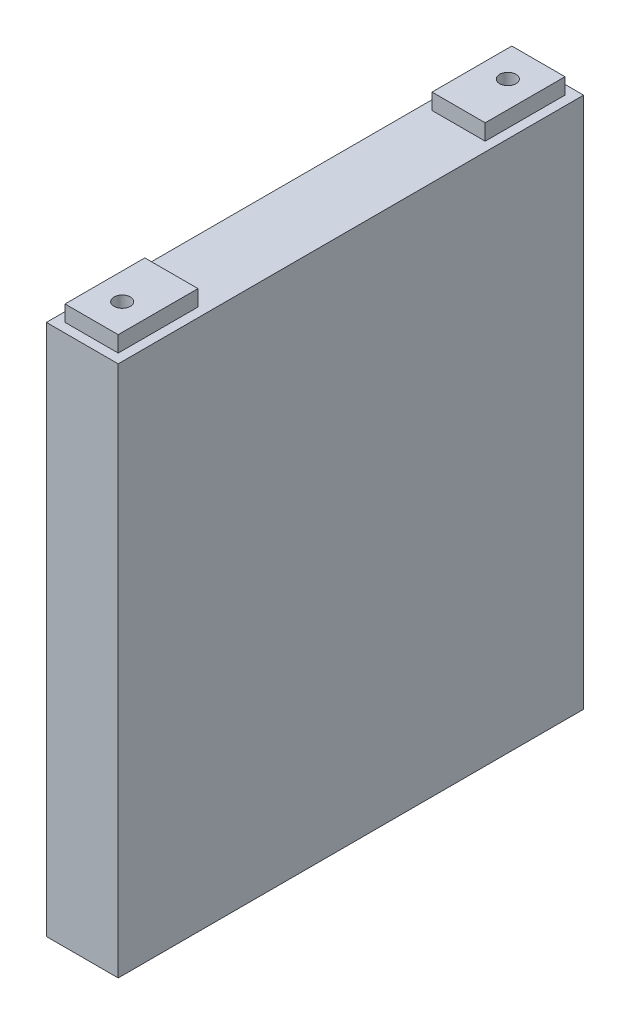
ISO-10303-21;
HEADER;
FILE_DESCRIPTION(('STEP AP214'),'2;1');
FILE_NAME('part.step','',(''),(''),'','','');
FILE_SCHEMA(('AUTOMOTIVE_DESIGN { 1 0 10303 214 1 1 1 1 }'));
ENDSEC;
DATA;
#1=APPLICATION_CONTEXT('core data for automotive mechanical design processes');
#2=APPLICATION_PROTOCOL_DEFINITION('international standard','automotive_design',2000,#1);
#3=PRODUCT_CONTEXT('',#1,'mechanical');
#4=PRODUCT('Part','Part','',(#3));
#5=PRODUCT_RELATED_PRODUCT_CATEGORY('part','',(#4));
#6=PRODUCT_DEFINITION_FORMATION('','',#4);
#7=PRODUCT_DEFINITION_CONTEXT('part definition',#1,'design');
#8=PRODUCT_DEFINITION('design','',#6,#7);
#9=PRODUCT_DEFINITION_SHAPE('','',#8);
#10=(LENGTH_UNIT() NAMED_UNIT(*) SI_UNIT(.MILLI.,.METRE.));
#11=(NAMED_UNIT(*) PLANE_ANGLE_UNIT() SI_UNIT($,.RADIAN.));
#12=(NAMED_UNIT(*) SI_UNIT($,.STERADIAN.) SOLID_ANGLE_UNIT());
#13=UNCERTAINTY_MEASURE_WITH_UNIT(LENGTH_MEASURE(1.E-05),#10,'distance_accuracy_value','');
#14=(GEOMETRIC_REPRESENTATION_CONTEXT(3) GLOBAL_UNCERTAINTY_ASSIGNED_CONTEXT((#13)) GLOBAL_UNIT_ASSIGNED_CONTEXT((#10,
#11,#12)) REPRESENTATION_CONTEXT('',''));
#15=CARTESIAN_POINT('',(0.,0.,0.));
#16=DIRECTION('',(0.,0.,1.));
#17=DIRECTION('',(1.,0.,0.));
#18=AXIS2_PLACEMENT_3D('',#15,#16,#17);
#19=CARTESIAN_POINT('',(13.5,200.,87.5));
#20=DIRECTION('',(-1.,0.,0.));
#21=DIRECTION('',(0.,0.,1.));
#22=AXIS2_PLACEMENT_3D('',#19,#20,#21);
#23=PLANE('',#22);
#24=DIRECTION('',(0.,0.,-1.));
#25=VECTOR('',#24,1.);
#26=CARTESIAN_POINT('',(13.5,0.,87.5));
#27=LINE('',#26,#25);
#28=CARTESIAN_POINT('',(13.5,0.,87.5));
#29=VERTEX_POINT('',#28);
#30=CARTESIAN_POINT('',(13.5,0.,-87.5));
#31=VERTEX_POINT('',#30);
#32=EDGE_CURVE('E235',#29,#31,#27,.T.);
#33=ORIENTED_EDGE('',*,*,#32,.T.);
#34=DIRECTION('',(0.,-1.,0.));
#35=VECTOR('',#34,1.);
#36=CARTESIAN_POINT('',(13.5,200.,-87.5));
#37=LINE('',#36,#35);
#38=CARTESIAN_POINT('',(13.5,200.,-87.5));
#39=VERTEX_POINT('',#38);
#40=EDGE_CURVE('E11',#39,#31,#37,.T.);
#41=ORIENTED_EDGE('',*,*,#40,.F.);
#42=DIRECTION('',(0.,0.,-1.));
#43=VECTOR('',#42,1.);
#44=CARTESIAN_POINT('',(13.5,200.,87.5));
#45=LINE('',#44,#43);
#46=CARTESIAN_POINT('',(13.5,200.,87.5));
#47=VERTEX_POINT('',#46);
#48=EDGE_CURVE('E236',#47,#39,#45,.T.);
#49=ORIENTED_EDGE('',*,*,#48,.F.);
#50=DIRECTION('',(0.,-1.,0.));
#51=VECTOR('',#50,1.);
#52=CARTESIAN_POINT('',(13.5,200.,87.5));
#53=LINE('',#52,#51);
#54=EDGE_CURVE('E250',#47,#29,#53,.T.);
#55=ORIENTED_EDGE('',*,*,#54,.T.);
#56=EDGE_LOOP('',(#33,#41,#49,#55));
#57=FACE_BOUND('',#56,.T.);
#58=ADVANCED_FACE('F43',(#57),#23,.F.);
#59=CARTESIAN_POINT('',(-13.5,200.,-87.5));
#60=DIRECTION('',(0.,0.,1.));
#61=DIRECTION('',(1.,0.,0.));
#62=AXIS2_PLACEMENT_3D('',#59,#60,#61);
#63=PLANE('',#62);
#64=DIRECTION('',(-1.,0.,0.));
#65=VECTOR('',#64,1.);
#66=CARTESIAN_POINT('',(-13.5,0.,-87.5));
#67=LINE('',#66,#65);
#68=CARTESIAN_POINT('',(-13.5,0.,-87.5));
#69=VERTEX_POINT('',#68);
#70=EDGE_CURVE('E254',#31,#69,#67,.T.);
#71=ORIENTED_EDGE('',*,*,#70,.T.);
#72=DIRECTION('',(0.,-1.,0.));
#73=VECTOR('',#72,1.);
#74=CARTESIAN_POINT('',(-13.5,200.,-87.5));
#75=LINE('',#74,#73);
#76=CARTESIAN_POINT('',(-13.5,200.,-87.5));
#77=VERTEX_POINT('',#76);
#78=EDGE_CURVE('E51',#77,#69,#75,.T.);
#79=ORIENTED_EDGE('',*,*,#78,.F.);
#80=DIRECTION('',(-1.,0.,0.));
#81=VECTOR('',#80,1.);
#82=CARTESIAN_POINT('',(-13.5,200.,-87.5));
#83=LINE('',#82,#81);
#84=EDGE_CURVE('E240',#39,#77,#83,.T.);
#85=ORIENTED_EDGE('',*,*,#84,.F.);
#86=ORIENTED_EDGE('',*,*,#40,.T.);
#87=EDGE_LOOP('',(#71,#79,#85,#86));
#88=FACE_BOUND('',#87,.T.);
#89=ADVANCED_FACE('F289',(#88),#63,.F.);
#90=CARTESIAN_POINT('',(-13.5,200.,87.5));
#91=DIRECTION('',(1.,0.,0.));
#92=DIRECTION('',(0.,0.,-1.));
#93=AXIS2_PLACEMENT_3D('',#90,#91,#92);
#94=PLANE('',#93);
#95=DIRECTION('',(0.,0.,1.));
#96=VECTOR('',#95,1.);
#97=CARTESIAN_POINT('',(-13.5,0.,87.5));
#98=LINE('',#97,#96);
#99=CARTESIAN_POINT('',(-13.5,0.,87.5));
#100=VERTEX_POINT('',#99);
#101=EDGE_CURVE('E257',#69,#100,#98,.T.);
#102=ORIENTED_EDGE('',*,*,#101,.T.);
#103=DIRECTION('',(0.,-1.,0.));
#104=VECTOR('',#103,1.);
#105=CARTESIAN_POINT('',(-13.5,200.,87.5));
#106=LINE('',#105,#104);
#107=CARTESIAN_POINT('',(-13.5,200.,87.5));
#108=VERTEX_POINT('',#107);
#109=EDGE_CURVE('E265',#108,#100,#106,.T.);
#110=ORIENTED_EDGE('',*,*,#109,.F.);
#111=DIRECTION('',(0.,0.,1.));
#112=VECTOR('',#111,1.);
#113=CARTESIAN_POINT('',(-13.5,200.,87.5));
#114=LINE('',#113,#112);
#115=EDGE_CURVE('E244',#77,#108,#114,.T.);
#116=ORIENTED_EDGE('',*,*,#115,.F.);
#117=ORIENTED_EDGE('',*,*,#78,.T.);
#118=EDGE_LOOP('',(#102,#110,#116,#117));
#119=FACE_BOUND('',#118,.T.);
#120=ADVANCED_FACE('F274',(#119),#94,.F.);
#121=CARTESIAN_POINT('',(-13.5,200.,87.5));
#122=DIRECTION('',(0.,0.,-1.));
#123=DIRECTION('',(-1.,0.,0.));
#124=AXIS2_PLACEMENT_3D('',#121,#122,#123);
#125=PLANE('',#124);
#126=DIRECTION('',(1.,0.,0.));
#127=VECTOR('',#126,1.);
#128=CARTESIAN_POINT('',(-13.5,0.,87.5));
#129=LINE('',#128,#127);
#130=EDGE_CURVE('E241',#100,#29,#129,.T.);
#131=ORIENTED_EDGE('',*,*,#130,.T.);
#132=ORIENTED_EDGE('',*,*,#54,.F.);
#133=DIRECTION('',(1.,0.,0.));
#134=VECTOR('',#133,1.);
#135=CARTESIAN_POINT('',(-13.5,200.,87.5));
#136=LINE('',#135,#134);
#137=EDGE_CURVE('E247',#108,#47,#136,.T.);
#138=ORIENTED_EDGE('',*,*,#137,.F.);
#139=ORIENTED_EDGE('',*,*,#109,.T.);
#140=EDGE_LOOP('',(#131,#132,#138,#139));
#141=FACE_BOUND('',#140,.T.);
#142=ADVANCED_FACE('F283',(#141),#125,.F.);
#143=CARTESIAN_POINT('',(0.,200.,0.));
#144=DIRECTION('',(0.,-1.,0.));
#145=DIRECTION('',(0.,0.,-1.));
#146=AXIS2_PLACEMENT_3D('',#143,#144,#145);
#147=PLANE('',#146);
#148=DIRECTION('',(0.,0.,-1.));
#149=VECTOR('',#148,1.);
#150=CARTESIAN_POINT('',(10.,200.,-54.));
#151=LINE('',#150,#149);
#152=CARTESIAN_POINT('',(10.,200.,-54.));
#153=VERTEX_POINT('',#152);
#154=CARTESIAN_POINT('',(10.,200.,-84.));
#155=VERTEX_POINT('',#154);
#156=EDGE_CURVE('E128',#153,#155,#151,.T.);
#157=ORIENTED_EDGE('',*,*,#156,.F.);
#158=DIRECTION('',(1.,0.,0.));
#159=VECTOR('',#158,1.);
#160=CARTESIAN_POINT('',(-10.,200.,-54.));
#161=LINE('',#160,#159);
#162=CARTESIAN_POINT('',(-10.,200.,-54.));
#163=VERTEX_POINT('',#162);
#164=EDGE_CURVE('E132',#163,#153,#161,.T.);
#165=ORIENTED_EDGE('',*,*,#164,.F.);
#166=DIRECTION('',(0.,0.,1.));
#167=VECTOR('',#166,1.);
#168=CARTESIAN_POINT('',(-10.,200.,-54.));
#169=LINE('',#168,#167);
#170=CARTESIAN_POINT('',(-10.,200.,-84.));
#171=VERTEX_POINT('',#170);
#172=EDGE_CURVE('E63',#171,#163,#169,.T.);
#173=ORIENTED_EDGE('',*,*,#172,.F.);
#174=DIRECTION('',(-1.,0.,0.));
#175=VECTOR('',#174,1.);
#176=CARTESIAN_POINT('',(-10.,200.,-84.));
#177=LINE('',#176,#175);
#178=EDGE_CURVE('E58',#155,#171,#177,.T.);
#179=ORIENTED_EDGE('',*,*,#178,.F.);
#180=EDGE_LOOP('',(#157,#165,#173,#179));
#181=FACE_BOUND('',#180,.T.);
#182=DIRECTION('',(0.,0.,-1.));
#183=VECTOR('',#182,1.);
#184=CARTESIAN_POINT('',(10.,200.,84.));
#185=LINE('',#184,#183);
#186=CARTESIAN_POINT('',(10.,200.,84.));
#187=VERTEX_POINT('',#186);
#188=CARTESIAN_POINT('',(10.,200.,54.));
#189=VERTEX_POINT('',#188);
#190=EDGE_CURVE('E187',#187,#189,#185,.T.);
#191=ORIENTED_EDGE('',*,*,#190,.F.);
#192=DIRECTION('',(1.,0.,0.));
#193=VECTOR('',#192,1.);
#194=CARTESIAN_POINT('',(-9.99999999999999,200.,84.));
#195=LINE('',#194,#193);
#196=CARTESIAN_POINT('',(-9.99999999999999,200.,84.));
#197=VERTEX_POINT('',#196);
#198=EDGE_CURVE('E196',#197,#187,#195,.T.);
#199=ORIENTED_EDGE('',*,*,#198,.F.);
#200=DIRECTION('',(0.,0.,1.));
#201=VECTOR('',#200,1.);
#202=CARTESIAN_POINT('',(-9.99999999999999,200.,84.));
#203=LINE('',#202,#201);
#204=CARTESIAN_POINT('',(-9.99999999999999,200.,54.));
#205=VERTEX_POINT('',#204);
#206=EDGE_CURVE('E213',#205,#197,#203,.T.);
#207=ORIENTED_EDGE('',*,*,#206,.F.);
#208=DIRECTION('',(-1.,0.,0.));
#209=VECTOR('',#208,1.);
#210=CARTESIAN_POINT('',(-9.99999999999999,200.,54.));
#211=LINE('',#210,#209);
#212=EDGE_CURVE('E209',#189,#205,#211,.T.);
#213=ORIENTED_EDGE('',*,*,#212,.F.);
#214=EDGE_LOOP('',(#191,#199,#207,#213));
#215=FACE_BOUND('',#214,.T.);
#216=ORIENTED_EDGE('',*,*,#48,.T.);
#217=ORIENTED_EDGE('',*,*,#84,.T.);
#218=ORIENTED_EDGE('',*,*,#115,.T.);
#219=ORIENTED_EDGE('',*,*,#137,.T.);
#220=EDGE_LOOP('',(#216,#217,#218,#219));
#221=FACE_BOUND('',#220,.T.);
#222=ADVANCED_FACE('F130',(#181,#215,#221),#147,.F.);
#223=CARTESIAN_POINT('',(0.,0.,0.));
#224=DIRECTION('',(0.,-1.,0.));
#225=DIRECTION('',(0.,0.,-1.));
#226=AXIS2_PLACEMENT_3D('',#223,#224,#225);
#227=PLANE('',#226);
#228=ORIENTED_EDGE('',*,*,#32,.F.);
#229=ORIENTED_EDGE('',*,*,#130,.F.);
#230=ORIENTED_EDGE('',*,*,#101,.F.);
#231=ORIENTED_EDGE('',*,*,#70,.F.);
#232=EDGE_LOOP('',(#228,#229,#230,#231));
#233=FACE_BOUND('',#232,.T.);
#234=ADVANCED_FACE('F280',(#233),#227,.T.);
#235=CARTESIAN_POINT('',(0.,206.,0.));
#236=DIRECTION('',(0.,-1.,0.));
#237=DIRECTION('',(0.,0.,-1.));
#238=AXIS2_PLACEMENT_3D('',#235,#236,#237);
#239=PLANE('',#238);
#240=DIRECTION('',(0.,0.,-1.));
#241=VECTOR('',#240,1.);
#242=CARTESIAN_POINT('',(10.,206.,84.));
#243=LINE('',#242,#241);
#244=CARTESIAN_POINT('',(10.,206.,84.));
#245=VERTEX_POINT('',#244);
#246=CARTESIAN_POINT('',(10.,206.,54.));
#247=VERTEX_POINT('',#246);
#248=EDGE_CURVE('E191',#245,#247,#243,.T.);
#249=ORIENTED_EDGE('',*,*,#248,.T.);
#250=DIRECTION('',(-1.,0.,0.));
#251=VECTOR('',#250,1.);
#252=CARTESIAN_POINT('',(-9.99999999999999,206.,54.));
#253=LINE('',#252,#251);
#254=CARTESIAN_POINT('',(-9.99999999999999,206.,54.));
#255=VERTEX_POINT('',#254);
#256=EDGE_CURVE('E195',#247,#255,#253,.T.);
#257=ORIENTED_EDGE('',*,*,#256,.T.);
#258=DIRECTION('',(0.,0.,1.));
#259=VECTOR('',#258,1.);
#260=CARTESIAN_POINT('',(-9.99999999999999,206.,84.));
#261=LINE('',#260,#259);
#262=CARTESIAN_POINT('',(-9.99999999999999,206.,84.));
#263=VERTEX_POINT('',#262);
#264=EDGE_CURVE('E199',#255,#263,#261,.T.);
#265=ORIENTED_EDGE('',*,*,#264,.T.);
#266=DIRECTION('',(1.,0.,0.));
#267=VECTOR('',#266,1.);
#268=CARTESIAN_POINT('',(-9.99999999999999,206.,84.));
#269=LINE('',#268,#267);
#270=EDGE_CURVE('E202',#263,#245,#269,.T.);
#271=ORIENTED_EDGE('',*,*,#270,.T.);
#272=EDGE_LOOP('',(#249,#257,#265,#271));
#273=FACE_BOUND('',#272,.T.);
#274=CARTESIAN_POINT('',(0.,206.,72.5));
#275=DIRECTION('',(0.,1.,0.));
#276=DIRECTION('',(0.,0.,1.));
#277=AXIS2_PLACEMENT_3D('',#274,#275,#276);
#278=CIRCLE('',#277,3.07188082464344);
#279=CARTESIAN_POINT('',(0.,206.,75.5718808246434));
#280=VERTEX_POINT('',#279);
#281=EDGE_CURVE('E183',#280,#280,#278,.T.);
#282=ORIENTED_EDGE('',*,*,#281,.F.);
#283=EDGE_LOOP('',(#282));
#284=FACE_BOUND('',#283,.T.);
#285=ADVANCED_FACE('F301',(#273,#284),#239,.F.);
#286=CARTESIAN_POINT('',(10.,206.,84.));
#287=DIRECTION('',(-1.,0.,0.));
#288=DIRECTION('',(0.,0.,1.));
#289=AXIS2_PLACEMENT_3D('',#286,#287,#288);
#290=PLANE('',#289);
#291=ORIENTED_EDGE('',*,*,#190,.T.);
#292=DIRECTION('',(0.,-1.,0.));
#293=VECTOR('',#292,1.);
#294=CARTESIAN_POINT('',(10.,206.,54.));
#295=LINE('',#294,#293);
#296=EDGE_CURVE('E231',#247,#189,#295,.T.);
#297=ORIENTED_EDGE('',*,*,#296,.F.);
#298=ORIENTED_EDGE('',*,*,#248,.F.);
#299=DIRECTION('',(0.,-1.,0.));
#300=VECTOR('',#299,1.);
#301=CARTESIAN_POINT('',(10.,206.,84.));
#302=LINE('',#301,#300);
#303=EDGE_CURVE('E205',#245,#187,#302,.T.);
#304=ORIENTED_EDGE('',*,*,#303,.T.);
#305=EDGE_LOOP('',(#291,#297,#298,#304));
#306=FACE_BOUND('',#305,.T.);
#307=ADVANCED_FACE('F306',(#306),#290,.F.);
#308=CARTESIAN_POINT('',(-9.99999999999999,206.,54.));
#309=DIRECTION('',(0.,0.,1.));
#310=DIRECTION('',(1.,0.,0.));
#311=AXIS2_PLACEMENT_3D('',#308,#309,#310);
#312=PLANE('',#311);
#313=ORIENTED_EDGE('',*,*,#212,.T.);
#314=DIRECTION('',(0.,-1.,0.));
#315=VECTOR('',#314,1.);
#316=CARTESIAN_POINT('',(-9.99999999999999,206.,54.));
#317=LINE('',#316,#315);
#318=EDGE_CURVE('E227',#255,#205,#317,.T.);
#319=ORIENTED_EDGE('',*,*,#318,.F.);
#320=ORIENTED_EDGE('',*,*,#256,.F.);
#321=ORIENTED_EDGE('',*,*,#296,.T.);
#322=EDGE_LOOP('',(#313,#319,#320,#321));
#323=FACE_BOUND('',#322,.T.);
#324=ADVANCED_FACE('F309',(#323),#312,.F.);
#325=CARTESIAN_POINT('',(-9.99999999999999,206.,84.));
#326=DIRECTION('',(1.,0.,0.));
#327=DIRECTION('',(0.,0.,-1.));
#328=AXIS2_PLACEMENT_3D('',#325,#326,#327);
#329=PLANE('',#328);
#330=ORIENTED_EDGE('',*,*,#206,.T.);
#331=DIRECTION('',(0.,-1.,0.));
#332=VECTOR('',#331,1.);
#333=CARTESIAN_POINT('',(-9.99999999999999,206.,84.));
#334=LINE('',#333,#332);
#335=EDGE_CURVE('E223',#263,#197,#334,.T.);
#336=ORIENTED_EDGE('',*,*,#335,.F.);
#337=ORIENTED_EDGE('',*,*,#264,.F.);
#338=ORIENTED_EDGE('',*,*,#318,.T.);
#339=EDGE_LOOP('',(#330,#336,#337,#338));
#340=FACE_BOUND('',#339,.T.);
#341=ADVANCED_FACE('F313',(#340),#329,.F.);
#342=CARTESIAN_POINT('',(-9.99999999999999,206.,84.));
#343=DIRECTION('',(0.,0.,-1.));
#344=DIRECTION('',(-1.,0.,0.));
#345=AXIS2_PLACEMENT_3D('',#342,#343,#344);
#346=PLANE('',#345);
#347=ORIENTED_EDGE('',*,*,#198,.T.);
#348=ORIENTED_EDGE('',*,*,#303,.F.);
#349=ORIENTED_EDGE('',*,*,#270,.F.);
#350=ORIENTED_EDGE('',*,*,#335,.T.);
#351=EDGE_LOOP('',(#347,#348,#349,#350));
#352=FACE_BOUND('',#351,.T.);
#353=ADVANCED_FACE('F317',(#352),#346,.F.);
#354=CARTESIAN_POINT('',(0.,206.,72.5));
#355=DIRECTION('',(0.,-1.,0.));
#356=DIRECTION('',(0.,0.,-1.));
#357=AXIS2_PLACEMENT_3D('',#354,#355,#356);
#358=CYLINDRICAL_SURFACE('',#357,3.07188082464344);
#359=ORIENTED_EDGE('',*,*,#281,.T.);
#360=EDGE_LOOP('',(#359));
#361=FACE_BOUND('',#360,.T.);
#362=CARTESIAN_POINT('',(0.,200.,72.5));
#363=DIRECTION('',(0.,1.,0.));
#364=DIRECTION('',(0.,0.,1.));
#365=AXIS2_PLACEMENT_3D('',#362,#363,#364);
#366=CIRCLE('',#365,3.07188082464344);
#367=CARTESIAN_POINT('',(0.,200.,75.5718808246434));
#368=VERTEX_POINT('',#367);
#369=EDGE_CURVE('E179',#368,#368,#366,.T.);
#370=ORIENTED_EDGE('',*,*,#369,.F.);
#371=EDGE_LOOP('',(#370));
#372=FACE_BOUND('',#371,.T.);
#373=ADVANCED_FACE('F321',(#361,#372),#358,.F.);
#374=ORIENTED_EDGE('',*,*,#369,.T.);
#375=EDGE_LOOP('',(#374));
#376=FACE_BOUND('',#375,.T.);
#377=ADVANCED_FACE('F305',(#376),#147,.F.);
#378=CARTESIAN_POINT('',(0.,206.,0.));
#379=DIRECTION('',(0.,-1.,0.));
#380=DIRECTION('',(0.,0.,-1.));
#381=AXIS2_PLACEMENT_3D('',#378,#379,#380);
#382=PLANE('',#381);
#383=DIRECTION('',(0.,0.,-1.));
#384=VECTOR('',#383,1.);
#385=CARTESIAN_POINT('',(10.,206.,-54.));
#386=LINE('',#385,#384);
#387=CARTESIAN_POINT('',(10.,206.,-54.));
#388=VERTEX_POINT('',#387);
#389=CARTESIAN_POINT('',(10.,206.,-84.));
#390=VERTEX_POINT('',#389);
#391=EDGE_CURVE('E149',#388,#390,#386,.T.);
#392=ORIENTED_EDGE('',*,*,#391,.T.);
#393=DIRECTION('',(-1.,0.,0.));
#394=VECTOR('',#393,1.);
#395=CARTESIAN_POINT('',(-10.,206.,-84.));
#396=LINE('',#395,#394);
#397=CARTESIAN_POINT('',(-10.,206.,-84.));
#398=VERTEX_POINT('',#397);
#399=EDGE_CURVE('E170',#390,#398,#396,.T.);
#400=ORIENTED_EDGE('',*,*,#399,.T.);
#401=DIRECTION('',(0.,0.,1.));
#402=VECTOR('',#401,1.);
#403=CARTESIAN_POINT('',(-10.,206.,-54.));
#404=LINE('',#403,#402);
#405=CARTESIAN_POINT('',(-10.,206.,-54.));
#406=VERTEX_POINT('',#405);
#407=EDGE_CURVE('E158',#398,#406,#404,.T.);
#408=ORIENTED_EDGE('',*,*,#407,.T.);
#409=DIRECTION('',(1.,0.,0.));
#410=VECTOR('',#409,1.);
#411=CARTESIAN_POINT('',(-10.,206.,-54.));
#412=LINE('',#411,#410);
#413=EDGE_CURVE('E154',#406,#388,#412,.T.);
#414=ORIENTED_EDGE('',*,*,#413,.T.);
#415=EDGE_LOOP('',(#392,#400,#408,#414));
#416=FACE_BOUND('',#415,.T.);
#417=CARTESIAN_POINT('',(0.,206.,-72.5));
#418=DIRECTION('',(0.,1.,0.));
#419=DIRECTION('',(0.,0.,1.));
#420=AXIS2_PLACEMENT_3D('',#417,#418,#419);
#421=CIRCLE('',#420,3.07188082464344);
#422=CARTESIAN_POINT('',(0.,206.,-69.4281191753565));
#423=VERTEX_POINT('',#422);
#424=EDGE_CURVE('E137',#423,#423,#421,.T.);
#425=ORIENTED_EDGE('',*,*,#424,.F.);
#426=EDGE_LOOP('',(#425));
#427=FACE_BOUND('',#426,.T.);
#428=ADVANCED_FACE('F333',(#416,#427),#382,.F.);
#429=CARTESIAN_POINT('',(10.,206.,-54.));
#430=DIRECTION('',(-1.,0.,0.));
#431=DIRECTION('',(0.,0.,1.));
#432=AXIS2_PLACEMENT_3D('',#429,#430,#431);
#433=PLANE('',#432);
#434=ORIENTED_EDGE('',*,*,#156,.T.);
#435=DIRECTION('',(0.,-1.,0.));
#436=VECTOR('',#435,1.);
#437=CARTESIAN_POINT('',(10.,206.,-84.));
#438=LINE('',#437,#436);
#439=EDGE_CURVE('E517',#390,#155,#438,.T.);
#440=ORIENTED_EDGE('',*,*,#439,.F.);
#441=ORIENTED_EDGE('',*,*,#391,.F.);
#442=DIRECTION('',(0.,-1.,0.));
#443=VECTOR('',#442,1.);
#444=CARTESIAN_POINT('',(10.,206.,-54.));
#445=LINE('',#444,#443);
#446=EDGE_CURVE('E144',#388,#153,#445,.T.);
#447=ORIENTED_EDGE('',*,*,#446,.T.);
#448=EDGE_LOOP('',(#434,#440,#441,#447));
#449=FACE_BOUND('',#448,.T.);
#450=ADVANCED_FACE('F151',(#449),#433,.F.);
#451=CARTESIAN_POINT('',(-10.,206.,-84.));
#452=DIRECTION('',(0.,0.,1.));
#453=DIRECTION('',(1.,0.,0.));
#454=AXIS2_PLACEMENT_3D('',#451,#452,#453);
#455=PLANE('',#454);
#456=ORIENTED_EDGE('',*,*,#178,.T.);
#457=DIRECTION('',(0.,-1.,0.));
#458=VECTOR('',#457,1.);
#459=CARTESIAN_POINT('',(-10.,206.,-84.));
#460=LINE('',#459,#458);
#461=EDGE_CURVE('E160',#398,#171,#460,.T.);
#462=ORIENTED_EDGE('',*,*,#461,.F.);
#463=ORIENTED_EDGE('',*,*,#399,.F.);
#464=ORIENTED_EDGE('',*,*,#439,.T.);
#465=EDGE_LOOP('',(#456,#462,#463,#464));
#466=FACE_BOUND('',#465,.T.);
#467=ADVANCED_FACE('F342',(#466),#455,.F.);
#468=CARTESIAN_POINT('',(-10.,206.,-54.));
#469=DIRECTION('',(1.,0.,0.));
#470=DIRECTION('',(0.,0.,-1.));
#471=AXIS2_PLACEMENT_3D('',#468,#469,#470);
#472=PLANE('',#471);
#473=ORIENTED_EDGE('',*,*,#172,.T.);
#474=DIRECTION('',(0.,-1.,0.));
#475=VECTOR('',#474,1.);
#476=CARTESIAN_POINT('',(-10.,206.,-54.));
#477=LINE('',#476,#475);
#478=EDGE_CURVE('E147',#406,#163,#477,.T.);
#479=ORIENTED_EDGE('',*,*,#478,.F.);
#480=ORIENTED_EDGE('',*,*,#407,.F.);
#481=ORIENTED_EDGE('',*,*,#461,.T.);
#482=EDGE_LOOP('',(#473,#479,#480,#481));
#483=FACE_BOUND('',#482,.T.);
#484=ADVANCED_FACE('F339',(#483),#472,.F.);
#485=CARTESIAN_POINT('',(-10.,206.,-54.));
#486=DIRECTION('',(0.,0.,-1.));
#487=DIRECTION('',(-1.,0.,0.));
#488=AXIS2_PLACEMENT_3D('',#485,#486,#487);
#489=PLANE('',#488);
#490=ORIENTED_EDGE('',*,*,#164,.T.);
#491=ORIENTED_EDGE('',*,*,#446,.F.);
#492=ORIENTED_EDGE('',*,*,#413,.F.);
#493=ORIENTED_EDGE('',*,*,#478,.T.);
#494=EDGE_LOOP('',(#490,#491,#492,#493));
#495=FACE_BOUND('',#494,.T.);
#496=ADVANCED_FACE('F142',(#495),#489,.F.);
#497=CARTESIAN_POINT('',(0.,206.,-72.5));
#498=DIRECTION('',(0.,-1.,0.));
#499=DIRECTION('',(0.,0.,-1.));
#500=AXIS2_PLACEMENT_3D('',#497,#498,#499);
#501=CYLINDRICAL_SURFACE('',#500,3.07188082464344);
#502=ORIENTED_EDGE('',*,*,#424,.T.);
#503=EDGE_LOOP('',(#502));
#504=FACE_BOUND('',#503,.T.);
#505=CARTESIAN_POINT('',(0.,200.,-72.5));
#506=DIRECTION('',(0.,1.,0.));
#507=DIRECTION('',(0.,0.,1.));
#508=AXIS2_PLACEMENT_3D('',#505,#506,#507);
#509=CIRCLE('',#508,3.07188082464344);
#510=CARTESIAN_POINT('',(0.,200.,-69.4281191753565));
#511=VERTEX_POINT('',#510);
#512=EDGE_CURVE('E175',#511,#511,#509,.T.);
#513=ORIENTED_EDGE('',*,*,#512,.F.);
#514=EDGE_LOOP('',(#513));
#515=FACE_BOUND('',#514,.T.);
#516=ADVANCED_FACE('F329',(#504,#515),#501,.F.);
#517=ORIENTED_EDGE('',*,*,#512,.T.);
#518=EDGE_LOOP('',(#517));
#519=FACE_BOUND('',#518,.T.);
#520=ADVANCED_FACE('F304',(#519),#147,.F.);
#521=CLOSED_SHELL('',(#58,#89,#120,#142,#222,#234,#285,#307,#324,#341,#353,#373,#377,#428,#450,
#467,#484,#496,#516,#520));
#522=MANIFOLD_SOLID_BREP('B2',#521);
#523=ADVANCED_BREP_SHAPE_REPRESENTATION('',(#18,#522),#14);
#524=SHAPE_DEFINITION_REPRESENTATION(#9,#523);
ENDSEC;
END-ISO-10303-21;
